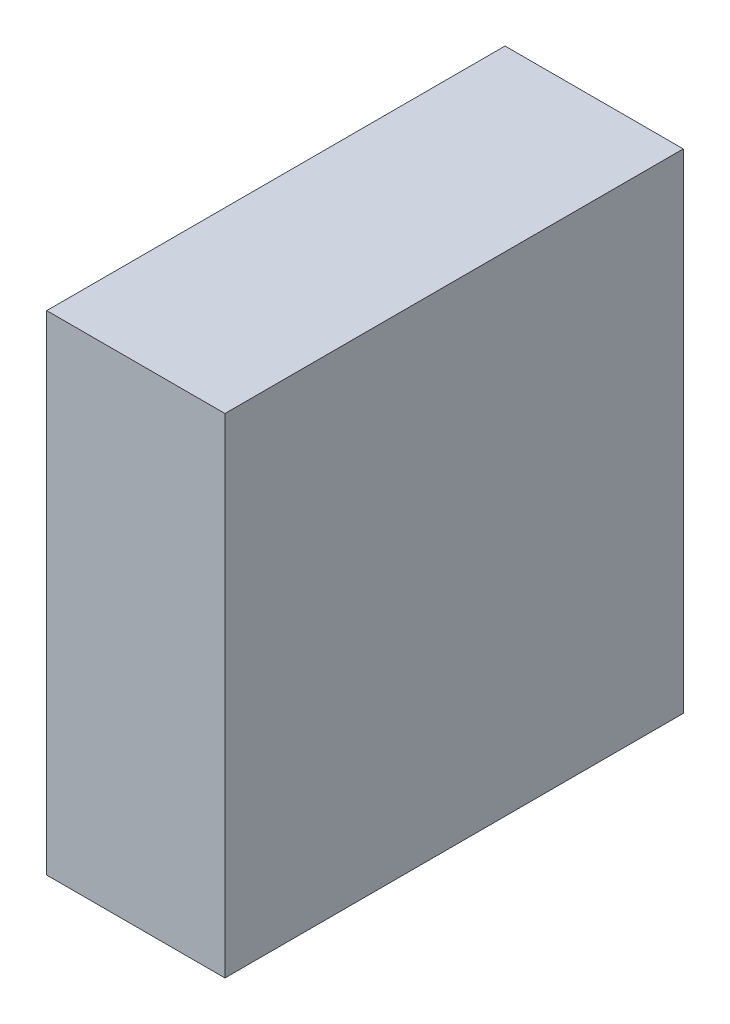
ISO-10303-21;
HEADER;
FILE_DESCRIPTION(('STEP AP214'),'2;1');
FILE_NAME('part.step','',(''),(''),'','','');
FILE_SCHEMA(('AUTOMOTIVE_DESIGN { 1 0 10303 214 1 1 1 1 }'));
ENDSEC;
DATA;
#1=APPLICATION_CONTEXT('core data for automotive mechanical design processes');
#2=APPLICATION_PROTOCOL_DEFINITION('international standard','automotive_design',2000,#1);
#3=PRODUCT_CONTEXT('',#1,'mechanical');
#4=PRODUCT('Part','Part','',(#3));
#5=PRODUCT_RELATED_PRODUCT_CATEGORY('part','',(#4));
#6=PRODUCT_DEFINITION_FORMATION('','',#4);
#7=PRODUCT_DEFINITION_CONTEXT('part definition',#1,'design');
#8=PRODUCT_DEFINITION('design','',#6,#7);
#9=PRODUCT_DEFINITION_SHAPE('','',#8);
#10=(LENGTH_UNIT() NAMED_UNIT(*) SI_UNIT(.MILLI.,.METRE.));
#11=(NAMED_UNIT(*) PLANE_ANGLE_UNIT() SI_UNIT($,.RADIAN.));
#12=(NAMED_UNIT(*) SI_UNIT($,.STERADIAN.) SOLID_ANGLE_UNIT());
#13=UNCERTAINTY_MEASURE_WITH_UNIT(LENGTH_MEASURE(1.E-05),#10,'distance_accuracy_value','');
#14=(GEOMETRIC_REPRESENTATION_CONTEXT(3) GLOBAL_UNCERTAINTY_ASSIGNED_CONTEXT((#13)) GLOBAL_UNIT_ASSIGNED_CONTEXT((#10,
#11,#12)) REPRESENTATION_CONTEXT('',''));
#15=CARTESIAN_POINT('',(0.,0.,0.));
#16=DIRECTION('',(0.,0.,1.));
#17=DIRECTION('',(1.,0.,0.));
#18=AXIS2_PLACEMENT_3D('',#15,#16,#17);
#19=CARTESIAN_POINT('',(-0.17500092,0.48000158,0.));
#20=DIRECTION('',(1.,0.,0.));
#21=DIRECTION('',(0.,0.,-1.));
#22=AXIS2_PLACEMENT_3D('',#19,#20,#21);
#23=PLANE('',#22);
#24=DIRECTION('',(0.,0.,1.));
#25=VECTOR('',#24,1.);
#26=CARTESIAN_POINT('',(-0.17500092,-0.47999904,0.));
#27=LINE('',#26,#25);
#28=CARTESIAN_POINT('',(-0.17500092,-0.47999904,0.));
#29=VERTEX_POINT('',#28);
#30=CARTESIAN_POINT('',(-0.17500092,-0.47999904,0.90000074));
#31=VERTEX_POINT('',#30);
#32=EDGE_CURVE('E19',#29,#31,#27,.T.);
#33=ORIENTED_EDGE('',*,*,#32,.T.);
#34=DIRECTION('',(0.,1.,0.));
#35=VECTOR('',#34,1.);
#36=CARTESIAN_POINT('',(-0.17500092,-0.47999904,0.90000074));
#37=LINE('',#36,#35);
#38=CARTESIAN_POINT('',(-0.17500092,0.48000158,0.90000074));
#39=VERTEX_POINT('',#38);
#40=EDGE_CURVE('E54',#31,#39,#37,.T.);
#41=ORIENTED_EDGE('',*,*,#40,.T.);
#42=DIRECTION('',(0.,0.,-1.));
#43=VECTOR('',#42,1.);
#44=CARTESIAN_POINT('',(-0.17500092,0.48000158,0.));
#45=LINE('',#44,#43);
#46=CARTESIAN_POINT('',(-0.17500092,0.48000158,0.));
#47=VERTEX_POINT('',#46);
#48=EDGE_CURVE('E75',#39,#47,#45,.T.);
#49=ORIENTED_EDGE('',*,*,#48,.T.);
#50=DIRECTION('',(0.,1.,0.));
#51=VECTOR('',#50,1.);
#52=CARTESIAN_POINT('',(-0.17500092,-0.47999904,0.));
#53=LINE('',#52,#51);
#54=EDGE_CURVE('E57',#29,#47,#53,.T.);
#55=ORIENTED_EDGE('',*,*,#54,.F.);
#56=EDGE_LOOP('',(#33,#41,#49,#55));
#57=FACE_BOUND('',#56,.T.);
#58=ADVANCED_FACE('F16',(#57),#23,.F.);
#59=CARTESIAN_POINT('',(-0.17500092,-0.47999904,0.));
#60=DIRECTION('',(0.,1.,0.));
#61=DIRECTION('',(0.,0.,1.));
#62=AXIS2_PLACEMENT_3D('',#59,#60,#61);
#63=PLANE('',#62);
#64=DIRECTION('',(0.,0.,1.));
#65=VECTOR('',#64,1.);
#66=CARTESIAN_POINT('',(0.17500092,-0.47999904,0.));
#67=LINE('',#66,#65);
#68=CARTESIAN_POINT('',(0.17500092,-0.47999904,0.));
#69=VERTEX_POINT('',#68);
#70=CARTESIAN_POINT('',(0.17500092,-0.47999904,0.90000074));
#71=VERTEX_POINT('',#70);
#72=EDGE_CURVE('E72',#69,#71,#67,.T.);
#73=ORIENTED_EDGE('',*,*,#72,.T.);
#74=DIRECTION('',(-1.,0.,0.));
#75=VECTOR('',#74,1.);
#76=CARTESIAN_POINT('',(0.17500092,-0.47999904,0.90000074));
#77=LINE('',#76,#75);
#78=EDGE_CURVE('E62',#71,#31,#77,.T.);
#79=ORIENTED_EDGE('',*,*,#78,.T.);
#80=ORIENTED_EDGE('',*,*,#32,.F.);
#81=DIRECTION('',(-1.,0.,0.));
#82=VECTOR('',#81,1.);
#83=CARTESIAN_POINT('',(0.17500092,-0.47999904,0.));
#84=LINE('',#83,#82);
#85=EDGE_CURVE('E77',#69,#29,#84,.T.);
#86=ORIENTED_EDGE('',*,*,#85,.F.);
#87=EDGE_LOOP('',(#73,#79,#80,#86));
#88=FACE_BOUND('',#87,.T.);
#89=ADVANCED_FACE('F71',(#88),#63,.F.);
#90=CARTESIAN_POINT('',(0.17500092,-0.47999904,0.90000074));
#91=DIRECTION('',(0.,0.,-1.));
#92=DIRECTION('',(-1.,0.,0.));
#93=AXIS2_PLACEMENT_3D('',#90,#91,#92);
#94=PLANE('',#93);
#95=DIRECTION('',(1.,0.,0.));
#96=VECTOR('',#95,1.);
#97=CARTESIAN_POINT('',(0.17500092,0.48000158,0.90000074));
#98=LINE('',#97,#96);
#99=CARTESIAN_POINT('',(0.17500092,0.48000158,0.90000074));
#100=VERTEX_POINT('',#99);
#101=EDGE_CURVE('E68',#100,#39,#98,.F.);
#102=ORIENTED_EDGE('',*,*,#101,.T.);
#103=ORIENTED_EDGE('',*,*,#40,.F.);
#104=ORIENTED_EDGE('',*,*,#78,.F.);
#105=DIRECTION('',(0.,1.,0.));
#106=VECTOR('',#105,1.);
#107=CARTESIAN_POINT('',(0.17500092,-0.47999904,0.90000074));
#108=LINE('',#107,#106);
#109=EDGE_CURVE('E82',#71,#100,#108,.T.);
#110=ORIENTED_EDGE('',*,*,#109,.T.);
#111=EDGE_LOOP('',(#102,#103,#104,#110));
#112=FACE_BOUND('',#111,.T.);
#113=ADVANCED_FACE('F65',(#112),#94,.F.);
#114=CARTESIAN_POINT('',(0.17500092,0.48000158,0.));
#115=DIRECTION('',(0.,-1.,0.));
#116=DIRECTION('',(0.,0.,-1.));
#117=AXIS2_PLACEMENT_3D('',#114,#115,#116);
#118=PLANE('',#117);
#119=ORIENTED_EDGE('',*,*,#48,.F.);
#120=ORIENTED_EDGE('',*,*,#101,.F.);
#121=DIRECTION('',(0.,0.,1.));
#122=VECTOR('',#121,1.);
#123=CARTESIAN_POINT('',(0.17500092,0.48000158,0.));
#124=LINE('',#123,#122);
#125=CARTESIAN_POINT('',(0.17500092,0.48000158,0.));
#126=VERTEX_POINT('',#125);
#127=EDGE_CURVE('E25',#100,#126,#124,.F.);
#128=ORIENTED_EDGE('',*,*,#127,.T.);
#129=DIRECTION('',(-1.,0.,0.));
#130=VECTOR('',#129,1.);
#131=CARTESIAN_POINT('',(0.17500092,0.48000158,0.));
#132=LINE('',#131,#130);
#133=EDGE_CURVE('E33',#47,#126,#132,.F.);
#134=ORIENTED_EDGE('',*,*,#133,.F.);
#135=EDGE_LOOP('',(#119,#120,#128,#134));
#136=FACE_BOUND('',#135,.T.);
#137=ADVANCED_FACE('F87',(#136),#118,.F.);
#138=CARTESIAN_POINT('',(0.17500092,-0.47999904,0.));
#139=DIRECTION('',(0.,0.,-1.));
#140=DIRECTION('',(-1.,0.,0.));
#141=AXIS2_PLACEMENT_3D('',#138,#139,#140);
#142=PLANE('',#141);
#143=ORIENTED_EDGE('',*,*,#133,.T.);
#144=DIRECTION('',(0.,1.,0.));
#145=VECTOR('',#144,1.);
#146=CARTESIAN_POINT('',(0.17500092,-0.47999904,0.));
#147=LINE('',#146,#145);
#148=EDGE_CURVE('E11',#126,#69,#147,.F.);
#149=ORIENTED_EDGE('',*,*,#148,.T.);
#150=ORIENTED_EDGE('',*,*,#85,.T.);
#151=ORIENTED_EDGE('',*,*,#54,.T.);
#152=EDGE_LOOP('',(#143,#149,#150,#151));
#153=FACE_BOUND('',#152,.T.);
#154=ADVANCED_FACE('F90',(#153),#142,.T.);
#155=CARTESIAN_POINT('',(0.17500092,-0.47999904,0.));
#156=DIRECTION('',(-1.,0.,0.));
#157=DIRECTION('',(0.,0.,1.));
#158=AXIS2_PLACEMENT_3D('',#155,#156,#157);
#159=PLANE('',#158);
#160=ORIENTED_EDGE('',*,*,#127,.F.);
#161=ORIENTED_EDGE('',*,*,#109,.F.);
#162=ORIENTED_EDGE('',*,*,#72,.F.);
#163=ORIENTED_EDGE('',*,*,#148,.F.);
#164=EDGE_LOOP('',(#160,#161,#162,#163));
#165=FACE_BOUND('',#164,.T.);
#166=ADVANCED_FACE('F89',(#165),#159,.F.);
#167=CLOSED_SHELL('',(#58,#89,#113,#137,#154,#166));
#168=MANIFOLD_SOLID_BREP('B1',#167);
#169=ADVANCED_BREP_SHAPE_REPRESENTATION('',(#18,#168),#14);
#170=SHAPE_DEFINITION_REPRESENTATION(#9,#169);
ENDSEC;
END-ISO-10303-21;
